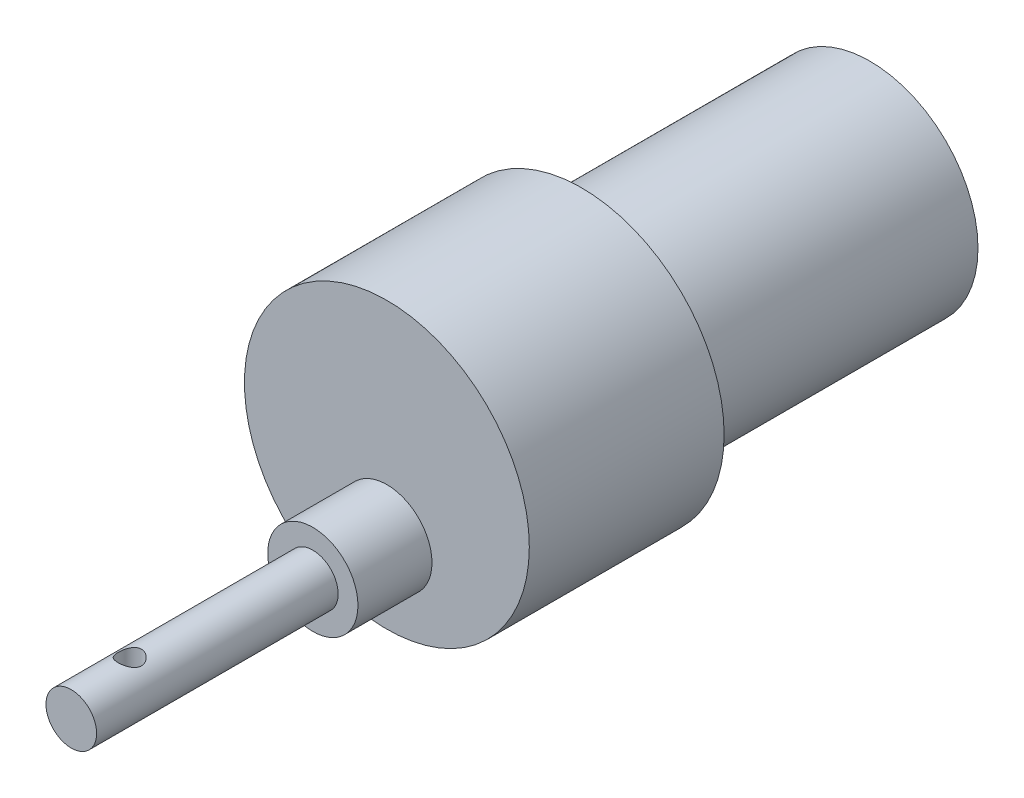
ISO-10303-21;
HEADER;
FILE_DESCRIPTION(('STEP AP214'),'2;1');
FILE_NAME('part.step','',(''),(''),'','','');
FILE_SCHEMA(('AUTOMOTIVE_DESIGN { 1 0 10303 214 1 1 1 1 }'));
ENDSEC;
DATA;
#1=APPLICATION_CONTEXT('core data for automotive mechanical design processes');
#2=APPLICATION_PROTOCOL_DEFINITION('international standard','automotive_design',2000,#1);
#3=PRODUCT_CONTEXT('',#1,'mechanical');
#4=PRODUCT('Part','Part','',(#3));
#5=PRODUCT_RELATED_PRODUCT_CATEGORY('part','',(#4));
#6=PRODUCT_DEFINITION_FORMATION('','',#4);
#7=PRODUCT_DEFINITION_CONTEXT('part definition',#1,'design');
#8=PRODUCT_DEFINITION('design','',#6,#7);
#9=PRODUCT_DEFINITION_SHAPE('','',#8);
#10=(LENGTH_UNIT() NAMED_UNIT(*) SI_UNIT(.MILLI.,.METRE.));
#11=(NAMED_UNIT(*) PLANE_ANGLE_UNIT() SI_UNIT($,.RADIAN.));
#12=(NAMED_UNIT(*) SI_UNIT($,.STERADIAN.) SOLID_ANGLE_UNIT());
#13=UNCERTAINTY_MEASURE_WITH_UNIT(LENGTH_MEASURE(1.E-05),#10,'distance_accuracy_value','');
#14=(GEOMETRIC_REPRESENTATION_CONTEXT(3) GLOBAL_UNCERTAINTY_ASSIGNED_CONTEXT((#13)) GLOBAL_UNIT_ASSIGNED_CONTEXT((#10,
#11,#12)) REPRESENTATION_CONTEXT('',''));
#15=CARTESIAN_POINT('',(0.,0.,0.));
#16=DIRECTION('',(0.,0.,1.));
#17=DIRECTION('',(1.,0.,0.));
#18=AXIS2_PLACEMENT_3D('',#15,#16,#17);
#19=CARTESIAN_POINT('',(0.,0.,62.));
#20=DIRECTION('',(0.,0.,-1.));
#21=DIRECTION('',(-1.,0.,0.));
#22=AXIS2_PLACEMENT_3D('',#19,#20,#21);
#23=CYLINDRICAL_SURFACE('',#22,13.86);
#24=CARTESIAN_POINT('',(0.,0.,0.));
#25=DIRECTION('',(0.,0.,1.));
#26=DIRECTION('',(1.,0.,0.));
#27=AXIS2_PLACEMENT_3D('',#24,#25,#26);
#28=CIRCLE('',#27,13.86);
#29=CARTESIAN_POINT('',(13.86,0.,0.));
#30=VERTEX_POINT('',#29);
#31=EDGE_CURVE('E65',#30,#30,#28,.T.);
#32=ORIENTED_EDGE('',*,*,#31,.T.);
#33=EDGE_LOOP('',(#32));
#34=FACE_BOUND('',#33,.T.);
#35=CARTESIAN_POINT('',(0.,0.,37.));
#36=DIRECTION('',(0.,0.,1.));
#37=DIRECTION('',(1.,0.,0.));
#38=AXIS2_PLACEMENT_3D('',#35,#36,#37);
#39=CIRCLE('',#38,13.86);
#40=CARTESIAN_POINT('',(13.86,0.,37.));
#41=VERTEX_POINT('',#40);
#42=EDGE_CURVE('E60',#41,#41,#39,.T.);
#43=ORIENTED_EDGE('',*,*,#42,.F.);
#44=EDGE_LOOP('',(#43));
#45=FACE_BOUND('',#44,.T.);
#46=ADVANCED_FACE('F48',(#34,#45),#23,.T.);
#47=CARTESIAN_POINT('',(0.,0.,0.));
#48=DIRECTION('',(0.,0.,1.));
#49=DIRECTION('',(1.,0.,0.));
#50=AXIS2_PLACEMENT_3D('',#47,#48,#49);
#51=PLANE('',#50);
#52=ORIENTED_EDGE('',*,*,#31,.F.);
#53=EDGE_LOOP('',(#52));
#54=FACE_BOUND('',#53,.T.);
#55=ADVANCED_FACE('F107',(#54),#51,.F.);
#56=CARTESIAN_POINT('',(0.,0.,62.));
#57=DIRECTION('',(0.,0.,-1.));
#58=DIRECTION('',(-1.,0.,0.));
#59=AXIS2_PLACEMENT_3D('',#56,#57,#58);
#60=CYLINDRICAL_SURFACE('',#59,18.28);
#61=CARTESIAN_POINT('',(0.,0.,62.));
#62=DIRECTION('',(0.,0.,1.));
#63=DIRECTION('',(1.,0.,0.));
#64=AXIS2_PLACEMENT_3D('',#61,#62,#63);
#65=CIRCLE('',#64,18.28);
#66=CARTESIAN_POINT('',(18.28,0.,62.));
#67=VERTEX_POINT('',#66);
#68=EDGE_CURVE('E77',#67,#67,#65,.T.);
#69=ORIENTED_EDGE('',*,*,#68,.F.);
#70=EDGE_LOOP('',(#69));
#71=FACE_BOUND('',#70,.T.);
#72=CARTESIAN_POINT('',(0.,0.,37.));
#73=DIRECTION('',(0.,0.,1.));
#74=DIRECTION('',(1.,0.,0.));
#75=AXIS2_PLACEMENT_3D('',#72,#73,#74);
#76=CIRCLE('',#75,18.28);
#77=CARTESIAN_POINT('',(18.28,0.,37.));
#78=VERTEX_POINT('',#77);
#79=EDGE_CURVE('E73',#78,#78,#76,.T.);
#80=ORIENTED_EDGE('',*,*,#79,.T.);
#81=EDGE_LOOP('',(#80));
#82=FACE_BOUND('',#81,.T.);
#83=ADVANCED_FACE('F112',(#71,#82),#60,.T.);
#84=CARTESIAN_POINT('',(0.,0.,37.));
#85=DIRECTION('',(0.,0.,1.));
#86=DIRECTION('',(1.,0.,0.));
#87=AXIS2_PLACEMENT_3D('',#84,#85,#86);
#88=PLANE('',#87);
#89=ORIENTED_EDGE('',*,*,#42,.T.);
#90=EDGE_LOOP('',(#89));
#91=FACE_BOUND('',#90,.T.);
#92=ORIENTED_EDGE('',*,*,#79,.F.);
#93=EDGE_LOOP('',(#92));
#94=FACE_BOUND('',#93,.T.);
#95=ADVANCED_FACE('F118',(#91,#94),#88,.F.);
#96=CARTESIAN_POINT('',(0.,0.,62.));
#97=DIRECTION('',(0.,0.,1.));
#98=DIRECTION('',(1.,0.,0.));
#99=AXIS2_PLACEMENT_3D('',#96,#97,#98);
#100=PLANE('',#99);
#101=CARTESIAN_POINT('',(0.,-7.99,62.));
#102=DIRECTION('',(0.,0.,1.));
#103=DIRECTION('',(1.,0.,0.));
#104=AXIS2_PLACEMENT_3D('',#101,#102,#103);
#105=CIRCLE('',#104,5.79);
#106=CARTESIAN_POINT('',(5.79,-7.99,62.));
#107=VERTEX_POINT('',#106);
#108=EDGE_CURVE('E74',#107,#107,#105,.T.);
#109=ORIENTED_EDGE('',*,*,#108,.F.);
#110=EDGE_LOOP('',(#109));
#111=FACE_BOUND('',#110,.T.);
#112=ORIENTED_EDGE('',*,*,#68,.T.);
#113=EDGE_LOOP('',(#112));
#114=FACE_BOUND('',#113,.T.);
#115=ADVANCED_FACE('F121',(#111,#114),#100,.T.);
#116=CARTESIAN_POINT('',(0.,-7.99,71.5));
#117=DIRECTION('',(0.,0.,-1.));
#118=DIRECTION('',(-1.,0.,0.));
#119=AXIS2_PLACEMENT_3D('',#116,#117,#118);
#120=CYLINDRICAL_SURFACE('',#119,5.79);
#121=CARTESIAN_POINT('',(0.,-7.99,71.5));
#122=DIRECTION('',(0.,0.,1.));
#123=DIRECTION('',(1.,0.,0.));
#124=AXIS2_PLACEMENT_3D('',#121,#122,#123);
#125=CIRCLE('',#124,5.79);
#126=CARTESIAN_POINT('',(5.79,-7.99,71.5));
#127=VERTEX_POINT('',#126);
#128=EDGE_CURVE('E70',#127,#127,#125,.T.);
#129=ORIENTED_EDGE('',*,*,#128,.F.);
#130=EDGE_LOOP('',(#129));
#131=FACE_BOUND('',#130,.T.);
#132=ORIENTED_EDGE('',*,*,#108,.T.);
#133=EDGE_LOOP('',(#132));
#134=FACE_BOUND('',#133,.T.);
#135=ADVANCED_FACE('F134',(#131,#134),#120,.T.);
#136=CARTESIAN_POINT('',(0.,-7.99,71.5));
#137=DIRECTION('',(0.,0.,1.));
#138=DIRECTION('',(1.,0.,0.));
#139=AXIS2_PLACEMENT_3D('',#136,#137,#138);
#140=PLANE('',#139);
#141=CARTESIAN_POINT('',(0.,-7.99,71.5));
#142=DIRECTION('',(0.,0.,1.));
#143=DIRECTION('',(1.,0.,0.));
#144=AXIS2_PLACEMENT_3D('',#141,#142,#143);
#145=CIRCLE('',#144,3.25);
#146=CARTESIAN_POINT('',(3.25,-7.99,71.5));
#147=VERTEX_POINT('',#146);
#148=EDGE_CURVE('E12',#147,#147,#145,.T.);
#149=ORIENTED_EDGE('',*,*,#148,.F.);
#150=EDGE_LOOP('',(#149));
#151=FACE_BOUND('',#150,.T.);
#152=ORIENTED_EDGE('',*,*,#128,.T.);
#153=EDGE_LOOP('',(#152));
#154=FACE_BOUND('',#153,.T.);
#155=ADVANCED_FACE('F103',(#151,#154),#140,.T.);
#156=CARTESIAN_POINT('',(0.,-7.99,102.5));
#157=DIRECTION('',(0.,0.,-1.));
#158=DIRECTION('',(-1.,0.,0.));
#159=AXIS2_PLACEMENT_3D('',#156,#157,#158);
#160=CYLINDRICAL_SURFACE('',#159,3.25);
#161=CARTESIAN_POINT('',(0.,-11.24,96.5));
#162=CARTESIAN_POINT('',(0.0795665336020402,-11.2399964824728,96.499995787521));
#163=CARTESIAN_POINT('',(0.159248802751997,-11.2370457852304,96.4936318652864));
#164=CARTESIAN_POINT('',(0.316302676462146,-11.2255347898597,96.4684368188158));
#165=CARTESIAN_POINT('',(0.393668644355887,-11.2169618132245,96.4495775159126));
#166=CARTESIAN_POINT('',(0.543571236651895,-11.1951126172015,96.4002613390825));
#167=CARTESIAN_POINT('',(0.616124459577149,-11.1818536812406,96.369847053397));
#168=CARTESIAN_POINT('',(0.75501150586327,-11.1518842864362,96.2984831664503));
#169=CARTESIAN_POINT('',(0.821346455351669,-11.1351744543117,96.2575354778342));
#170=CARTESIAN_POINT('',(0.949934488652826,-11.0988303550097,96.1637412957995));
#171=CARTESIAN_POINT('',(1.01177584846844,-11.0790871070793,96.1103730891206));
#172=CARTESIAN_POINT('',(1.12599874800721,-11.0393100602554,95.9943643723519));
#173=CARTESIAN_POINT('',(1.17837420047774,-11.0192760832839,95.9317179424784));
#174=CARTESIAN_POINT('',(1.27548887178323,-10.9797410102294,95.7941390566843));
#175=CARTESIAN_POINT('',(1.31953284801044,-10.9603543512364,95.7186793017865));
#176=CARTESIAN_POINT('',(1.39412192936299,-10.9260893954615,95.5604132530109));
#177=CARTESIAN_POINT('',(1.42467548371612,-10.9112082786405,95.4776115966009));
#178=CARTESIAN_POINT('',(1.46962454078475,-10.8888457139591,95.3117245268469));
#179=CARTESIAN_POINT('',(1.4848179245708,-10.8810015734653,95.2289063804143));
#180=CARTESIAN_POINT('',(1.50108773838038,-10.8725906668659,95.0615542706928));
#181=CARTESIAN_POINT('',(1.50217478633585,-10.8720184271594,94.9770216459131));
#182=CARTESIAN_POINT('',(1.49079280088205,-10.8779164235216,94.8175256844061));
#183=CARTESIAN_POINT('',(1.47964335102251,-10.8837011993326,94.7424372111908));
#184=CARTESIAN_POINT('',(1.44635609280636,-10.9004806782819,94.5953488838788));
#185=CARTESIAN_POINT('',(1.42421554815286,-10.911476678754,94.5233498037562));
#186=CARTESIAN_POINT('',(1.36913890476633,-10.9376945635919,94.3824957158733));
#187=CARTESIAN_POINT('',(1.33596673085205,-10.9530076322656,94.3137507726206));
#188=CARTESIAN_POINT('',(1.2599408085694,-10.9861251942995,94.1824992310562));
#189=CARTESIAN_POINT('',(1.21708286028503,-11.0039307671733,94.1199953559801));
#190=CARTESIAN_POINT('',(1.11759089744586,-11.0423140447298,93.9960295930866));
#191=CARTESIAN_POINT('',(1.05997849303938,-11.0629856005201,93.9353794713411));
#192=CARTESIAN_POINT('',(0.93525063284136,-11.1032136151515,93.8242944951355));
#193=CARTESIAN_POINT('',(0.868131859637581,-11.1227696813672,93.7738632217161));
#194=CARTESIAN_POINT('',(0.723348423753627,-11.1593883778069,93.6830680936934));
#195=CARTESIAN_POINT('',(0.645401966429369,-11.1763430967401,93.6431066922417));
#196=CARTESIAN_POINT('',(0.482909298354606,-11.2049781510309,93.5771606394507));
#197=CARTESIAN_POINT('',(0.398367620109635,-11.2166620718881,93.5511664844807));
#198=CARTESIAN_POINT('',(0.231801419726399,-11.2327218040747,93.5157584231729));
#199=CARTESIAN_POINT('',(0.150053680320634,-11.2375744913158,93.5052597924311));
#200=CARTESIAN_POINT('',(-0.0141754579229681,-11.241005131626,93.4978189350661));
#201=CARTESIAN_POINT('',(-0.0966565689646179,-11.2395854463303,93.5008716061922));
#202=CARTESIAN_POINT('',(-0.254447728851398,-11.2309269508323,93.5197405086181));
#203=CARTESIAN_POINT('',(-0.329879815922768,-11.2240647154841,93.534731016318));
#204=CARTESIAN_POINT('',(-0.47703968174818,-11.205654730005,93.5758259707681));
#205=CARTESIAN_POINT('',(-0.548767021851264,-11.1941064264594,93.6019317302237));
#206=CARTESIAN_POINT('',(-0.689005049925919,-11.1669534581523,93.6653176562795));
#207=CARTESIAN_POINT('',(-0.75734840788269,-11.1512347190555,93.7029174973217));
#208=CARTESIAN_POINT('',(-0.886999363186387,-11.1173358986766,93.7878753743237));
#209=CARTESIAN_POINT('',(-0.948303850462297,-11.0991547370659,93.8352376981244));
#210=CARTESIAN_POINT('',(-1.06771605589661,-11.0603024090195,93.9431170185809));
#211=CARTESIAN_POINT('',(-1.12509321772053,-11.0395516736676,94.0044158349319));
#212=CARTESIAN_POINT('',(-1.22901796417977,-10.9991743111415,94.1359711553179));
#213=CARTESIAN_POINT('',(-1.27556070251233,-10.9795481899615,94.206231646296));
#214=CARTESIAN_POINT('',(-1.35774539209929,-10.9431533168398,94.3565122225598));
#215=CARTESIAN_POINT('',(-1.39301513194685,-10.9264889220204,94.4367631918532));
#216=CARTESIAN_POINT('',(-1.44918714325353,-10.8991835105804,94.6030877230937));
#217=CARTESIAN_POINT('',(-1.47010488786372,-10.8885360092279,94.689154904117));
#218=CARTESIAN_POINT('',(-1.49529060984287,-10.8756174532217,94.8564321692355));
#219=CARTESIAN_POINT('',(-1.50087454782971,-10.8726853235251,94.9373929418536));
#220=CARTESIAN_POINT('',(-1.49890349615771,-10.8737114444469,95.0990993783274));
#221=CARTESIAN_POINT('',(-1.49135196602765,-10.8776678808026,95.179845093214));
#222=CARTESIAN_POINT('',(-1.4645026372222,-10.89136714358,95.3329450912279));
#223=CARTESIAN_POINT('',(-1.44606164108053,-10.9006867438273,95.4054916725594));
#224=CARTESIAN_POINT('',(-1.39890570133608,-10.9236404902673,95.5464331262932));
#225=CARTESIAN_POINT('',(-1.37018772156748,-10.9372759113608,95.6148267647851));
#226=CARTESIAN_POINT('',(-1.30114142777073,-10.9684312806135,95.7504660004963));
#227=CARTESIAN_POINT('',(-1.26017322224184,-10.9861478662505,95.8173395867084));
#228=CARTESIAN_POINT('',(-1.16858143831045,-11.0230436879651,95.9436688753762));
#229=CARTESIAN_POINT('',(-1.1179534539562,-11.0422235890751,96.0031211723353));
#230=CARTESIAN_POINT('',(-1.00267081983322,-11.0821220762857,96.1189084266444));
#231=CARTESIAN_POINT('',(-0.93713072208963,-11.1028088140642,96.1743773440259));
#232=CARTESIAN_POINT('',(-0.796983612052282,-11.1416023694661,96.2736519598549));
#233=CARTESIAN_POINT('',(-0.722372364022922,-11.1597079732006,96.3174521789542));
#234=CARTESIAN_POINT('',(-0.566452903867861,-11.1912362062055,96.3915937351064));
#235=CARTESIAN_POINT('',(-0.485194228853798,-11.2046901573167,96.4220254800127));
#236=CARTESIAN_POINT('',(-0.318047129151273,-11.2254884135612,96.468442221957));
#237=CARTESIAN_POINT('',(-0.232173392454843,-11.2328510059526,96.4844704732234));
#238=CARTESIAN_POINT('',(-0.121381352624889,-11.2378239925252,96.4952796609948));
#239=CARTESIAN_POINT('',(-0.0971493876498588,-11.2386384195862,96.4970479318607));
#240=CARTESIAN_POINT('',(-0.0486152181100391,-11.2397269656243,96.4994087555787));
#241=CARTESIAN_POINT('',(-0.0243130122848309,-11.2400010748449,96.5000012872002));
#242=CARTESIAN_POINT('',(0.,-11.24,96.5));
#243=B_SPLINE_CURVE_WITH_KNOTS('',3,(#161,#162,#163,#164,#165,#166,#167,#168,#169,#170,#171,
#172,#173,#174,#175,#176,#177,#178,#179,#180,#181,#182,#183,#184,#185,#186,#187,#188,#189,#190,
#191,#192,#193,#194,#195,#196,#197,#198,#199,#200,#201,#202,#203,#204,#205,#206,#207,#208,#209,
#210,#211,#212,#213,#214,#215,#216,#217,#218,#219,#220,#221,#222,#223,#224,#225,#226,#227,#228,
#229,#230,#231,#232,#233,#234,#235,#236,#237,#238,#239,#240,#241,#242),.UNSPECIFIED.,.T.,.F.,(4,
2,2,2,2,2,2,2,2,2,2,2,2,2,2,2,2,2,2,2,2,2,2,2,2,2,2,2,2,2,2,2,2,2,2,2,2,2,2,2,4),(0.,
0.238600102483911,0.477740118245305,0.716007153654809,0.954230955270989,1.20527368348811,
1.45647728005177,1.72361737244145,1.99058991333629,2.24284530975918,2.49491082085965,
2.72224505371486,2.94963591115234,3.18224489338961,3.41495493301191,3.67231630672516,
3.92976771345169,4.19600797435802,4.46206684922304,4.70843465098173,4.95470969975968,
5.18529144757862,5.41590043453886,5.65361863134685,5.89144146118222,6.14975555625564,
6.40818497569821,6.67442949381562,6.94038651584685,7.18267705005868,7.42490378112663,
7.65022078469501,7.87560440949581,8.11582604918685,8.35615752018291,8.6198711271926,
8.88370835055028,9.14573275427445,9.40696763362013,9.47987495044763,9.55278358376661),.UNSPECIFIED.);
#244=CARTESIAN_POINT('',(0.,-11.24,96.5));
#245=VERTEX_POINT('',#244);
#246=EDGE_CURVE('E51',#245,#245,#243,.T.);
#247=ORIENTED_EDGE('',*,*,#246,.T.);
#248=EDGE_LOOP('',(#247));
#249=FACE_BOUND('',#248,.T.);
#250=CARTESIAN_POINT('',(0.,-4.74,96.5));
#251=CARTESIAN_POINT('',(-0.0795665336020402,-4.74000351752723,96.499995787521));
#252=CARTESIAN_POINT('',(-0.159248802751997,-4.74295421476959,96.4936318652864));
#253=CARTESIAN_POINT('',(-0.316302676462146,-4.7544652101403,96.4684368188158));
#254=CARTESIAN_POINT('',(-0.393668644355887,-4.76303818677546,96.4495775159126));
#255=CARTESIAN_POINT('',(-0.543571236651895,-4.7848873827985,96.4002613390825));
#256=CARTESIAN_POINT('',(-0.616124459577149,-4.79814631875943,96.369847053397));
#257=CARTESIAN_POINT('',(-0.75501150586327,-4.82811571356377,96.2984831664503));
#258=CARTESIAN_POINT('',(-0.821346455351669,-4.84482554568835,96.2575354778342));
#259=CARTESIAN_POINT('',(-0.949934488652826,-4.88116964499027,96.1637412957995));
#260=CARTESIAN_POINT('',(-1.01177584846844,-4.90091289292072,96.1103730891206));
#261=CARTESIAN_POINT('',(-1.12599874800721,-4.94068993974456,95.9943643723519));
#262=CARTESIAN_POINT('',(-1.17837420047774,-4.96072391671612,95.9317179424784));
#263=CARTESIAN_POINT('',(-1.27548887178323,-5.00025898977059,95.7941390566843));
#264=CARTESIAN_POINT('',(-1.31953284801044,-5.01964564876359,95.7186793017865));
#265=CARTESIAN_POINT('',(-1.39412192936299,-5.05391060453849,95.5604132530109));
#266=CARTESIAN_POINT('',(-1.42467548371612,-5.06879172135948,95.4776115966009));
#267=CARTESIAN_POINT('',(-1.46962454078475,-5.09115428604094,95.3117245268469));
#268=CARTESIAN_POINT('',(-1.4848179245708,-5.0989984265347,95.2289063804143));
#269=CARTESIAN_POINT('',(-1.50108773838038,-5.10740933313408,95.0615542706928));
#270=CARTESIAN_POINT('',(-1.50217478633585,-5.10798157284062,94.9770216459131));
#271=CARTESIAN_POINT('',(-1.49079280088205,-5.10208357647845,94.8175256844061));
#272=CARTESIAN_POINT('',(-1.47964335102251,-5.09629880066741,94.7424372111908));
#273=CARTESIAN_POINT('',(-1.44635609280636,-5.07951932171808,94.5953488838788));
#274=CARTESIAN_POINT('',(-1.42421554815286,-5.06852332124604,94.5233498037562));
#275=CARTESIAN_POINT('',(-1.36913890476633,-5.04230543640806,94.3824957158733));
#276=CARTESIAN_POINT('',(-1.33596673085205,-5.02699236773443,94.3137507726206));
#277=CARTESIAN_POINT('',(-1.2599408085694,-4.99387480570052,94.1824992310562));
#278=CARTESIAN_POINT('',(-1.21708286028503,-4.97606923282669,94.1199953559801));
#279=CARTESIAN_POINT('',(-1.11759089744586,-4.93768595527021,93.9960295930866));
#280=CARTESIAN_POINT('',(-1.05997849303938,-4.91701439947994,93.9353794713411));
#281=CARTESIAN_POINT('',(-0.935250632841355,-4.87678638484851,93.8242944951355));
#282=CARTESIAN_POINT('',(-0.868131859637579,-4.85723031863276,93.7738632217161));
#283=CARTESIAN_POINT('',(-0.723348423753627,-4.82061162219313,93.6830680936934));
#284=CARTESIAN_POINT('',(-0.64540196642937,-4.80365690325991,93.6431066922417));
#285=CARTESIAN_POINT('',(-0.482909298354606,-4.77502184896911,93.5771606394507));
#286=CARTESIAN_POINT('',(-0.398367620109635,-4.76333792811189,93.5511664844807));
#287=CARTESIAN_POINT('',(-0.231801419726399,-4.7472781959253,93.5157584231729));
#288=CARTESIAN_POINT('',(-0.150053680320635,-4.74242550868423,93.5052597924311));
#289=CARTESIAN_POINT('',(0.0141754579229679,-4.73899486837397,93.4978189350661));
#290=CARTESIAN_POINT('',(0.096656568964618,-4.7404145536697,93.5008716061922));
#291=CARTESIAN_POINT('',(0.254447728851401,-4.74907304916771,93.5197405086181));
#292=CARTESIAN_POINT('',(0.329879815922774,-4.75593528451591,93.534731016318));
#293=CARTESIAN_POINT('',(0.477039681748186,-4.77434526999505,93.5758259707681));
#294=CARTESIAN_POINT('',(0.548767021851267,-4.78589357354064,93.6019317302237));
#295=CARTESIAN_POINT('',(0.689005049925918,-4.81304654184772,93.6653176562795));
#296=CARTESIAN_POINT('',(0.757348407882689,-4.8287652809445,93.7029174973217));
#297=CARTESIAN_POINT('',(0.886999363186382,-4.86266410132341,93.7878753743237));
#298=CARTESIAN_POINT('',(0.948303850462288,-4.88084526293413,93.8352376981244));
#299=CARTESIAN_POINT('',(1.0677160558966,-4.91969759098051,93.9431170185809));
#300=CARTESIAN_POINT('',(1.12509321772053,-4.94044832633235,94.0044158349319));
#301=CARTESIAN_POINT('',(1.22901796417977,-4.98082568885848,94.1359711553179));
#302=CARTESIAN_POINT('',(1.27556070251232,-5.00045181003849,94.206231646296));
#303=CARTESIAN_POINT('',(1.35774539209928,-5.03684668316023,94.3565122225598));
#304=CARTESIAN_POINT('',(1.39301513194685,-5.05351107797963,94.4367631918531));
#305=CARTESIAN_POINT('',(1.44918714325354,-5.08081648941964,94.6030877230937));
#306=CARTESIAN_POINT('',(1.47010488786372,-5.09146399077208,94.6891549041169));
#307=CARTESIAN_POINT('',(1.49529060984287,-5.10438254677831,94.8564321692355));
#308=CARTESIAN_POINT('',(1.50087454782971,-5.1073146764749,94.9373929418536));
#309=CARTESIAN_POINT('',(1.49890349615771,-5.10628855555312,95.0990993783274));
#310=CARTESIAN_POINT('',(1.49135196602765,-5.10233211919738,95.179845093214));
#311=CARTESIAN_POINT('',(1.4645026372222,-5.08863285641999,95.3329450912279));
#312=CARTESIAN_POINT('',(1.44606164108053,-5.07931325617275,95.4054916725594));
#313=CARTESIAN_POINT('',(1.39890570133608,-5.05635950973268,95.5464331262932));
#314=CARTESIAN_POINT('',(1.37018772156748,-5.04272408863924,95.6148267647851));
#315=CARTESIAN_POINT('',(1.30114142777073,-5.01156871938648,95.7504660004963));
#316=CARTESIAN_POINT('',(1.26017322224184,-4.99385213374951,95.8173395867084));
#317=CARTESIAN_POINT('',(1.16858143831045,-4.9569563120349,95.9436688753762));
#318=CARTESIAN_POINT('',(1.1179534539562,-4.93777641092492,96.0031211723353));
#319=CARTESIAN_POINT('',(1.00267081983322,-4.89787792371429,96.1189084266444));
#320=CARTESIAN_POINT('',(0.93713072208963,-4.8771911859358,96.1743773440259));
#321=CARTESIAN_POINT('',(0.796983612052281,-4.83839763053393,96.2736519598549));
#322=CARTESIAN_POINT('',(0.722372364022921,-4.82029202679941,96.3174521789542));
#323=CARTESIAN_POINT('',(0.566452903867861,-4.7887637937945,96.3915937351064));
#324=CARTESIAN_POINT('',(0.485194228853799,-4.77530984268335,96.4220254800127));
#325=CARTESIAN_POINT('',(0.318047129151273,-4.75451158643877,96.468442221957));
#326=CARTESIAN_POINT('',(0.232173392454843,-4.74714899404736,96.4844704732234));
#327=CARTESIAN_POINT('',(0.121381352624889,-4.74217600747479,96.4952796609948));
#328=CARTESIAN_POINT('',(0.0971493876498584,-4.74136158041381,96.4970479318607));
#329=CARTESIAN_POINT('',(0.048615218110039,-4.74027303437565,96.4994087555787));
#330=CARTESIAN_POINT('',(0.0243130122848308,-4.7399989251551,96.5000012872002));
#331=CARTESIAN_POINT('',(0.,-4.74,96.5));
#332=B_SPLINE_CURVE_WITH_KNOTS('',3,(#250,#251,#252,#253,#254,#255,#256,#257,#258,#259,#260,
#261,#262,#263,#264,#265,#266,#267,#268,#269,#270,#271,#272,#273,#274,#275,#276,#277,#278,#279,
#280,#281,#282,#283,#284,#285,#286,#287,#288,#289,#290,#291,#292,#293,#294,#295,#296,#297,#298,
#299,#300,#301,#302,#303,#304,#305,#306,#307,#308,#309,#310,#311,#312,#313,#314,#315,#316,#317,
#318,#319,#320,#321,#322,#323,#324,#325,#326,#327,#328,#329,#330,#331),.UNSPECIFIED.,.T.,.F.,(4,
2,2,2,2,2,2,2,2,2,2,2,2,2,2,2,2,2,2,2,2,2,2,2,2,2,2,2,2,2,2,2,2,2,2,2,2,2,2,2,4),(0.,
0.23860010248391,0.477740118245305,0.716007153654809,0.954230955270988,1.20527368348811,
1.45647728005177,1.72361737244145,1.99058991333629,2.24284530975918,2.49491082085965,
2.72224505371486,2.94963591115234,3.18224489338961,3.41495493301191,3.67231630672516,
3.92976771345169,4.19600797435802,4.46206684922304,4.70843465098173,4.95470969975968,
5.18529144757863,5.41590043453886,5.65361863134685,5.8914414611822,6.14975555625562,
6.4081849756982,6.6744294938156,6.94038651584684,7.18267705005868,7.42490378112662,
7.650220784695,7.8756044094958,8.11582604918685,8.3561575201829,8.61987112719259,
8.88370835055027,9.14573275427444,9.40696763362012,9.47987495044763,9.5527835837666),.UNSPECIFIED.);
#333=CARTESIAN_POINT('',(0.,-4.74,96.5));
#334=VERTEX_POINT('',#333);
#335=EDGE_CURVE('E83',#334,#334,#332,.T.);
#336=ORIENTED_EDGE('',*,*,#335,.T.);
#337=EDGE_LOOP('',(#336));
#338=FACE_BOUND('',#337,.T.);
#339=CARTESIAN_POINT('',(0.,-7.99,102.5));
#340=DIRECTION('',(0.,0.,1.));
#341=DIRECTION('',(1.,0.,0.));
#342=AXIS2_PLACEMENT_3D('',#339,#340,#341);
#343=CIRCLE('',#342,3.25);
#344=CARTESIAN_POINT('',(3.25,-7.99,102.5));
#345=VERTEX_POINT('',#344);
#346=EDGE_CURVE('E69',#345,#345,#343,.T.);
#347=ORIENTED_EDGE('',*,*,#346,.F.);
#348=EDGE_LOOP('',(#347));
#349=FACE_BOUND('',#348,.T.);
#350=ORIENTED_EDGE('',*,*,#148,.T.);
#351=EDGE_LOOP('',(#350));
#352=FACE_BOUND('',#351,.T.);
#353=ADVANCED_FACE('F88',(#249,#338,#349,#352),#160,.T.);
#354=CARTESIAN_POINT('',(0.,-7.99,102.5));
#355=DIRECTION('',(0.,0.,1.));
#356=DIRECTION('',(1.,0.,0.));
#357=AXIS2_PLACEMENT_3D('',#354,#355,#356);
#358=PLANE('',#357);
#359=ORIENTED_EDGE('',*,*,#346,.T.);
#360=EDGE_LOOP('',(#359));
#361=FACE_BOUND('',#360,.T.);
#362=ADVANCED_FACE('F95',(#361),#358,.T.);
#363=CARTESIAN_POINT('',(0.,-20.,95.));
#364=DIRECTION('',(0.,1.,0.));
#365=DIRECTION('',(0.,0.,1.));
#366=AXIS2_PLACEMENT_3D('',#363,#364,#365);
#367=CYLINDRICAL_SURFACE('',#366,1.5);
#368=ORIENTED_EDGE('',*,*,#335,.F.);
#369=EDGE_LOOP('',(#368));
#370=FACE_BOUND('',#369,.T.);
#371=ORIENTED_EDGE('',*,*,#246,.F.);
#372=EDGE_LOOP('',(#371));
#373=FACE_BOUND('',#372,.T.);
#374=ADVANCED_FACE('F92',(#370,#373),#367,.F.);
#375=CLOSED_SHELL('',(#46,#55,#83,#95,#115,#135,#155,#353,#362,#374));
#376=MANIFOLD_SOLID_BREP('B2',#375);
#377=ADVANCED_BREP_SHAPE_REPRESENTATION('',(#18,#376),#14);
#378=SHAPE_DEFINITION_REPRESENTATION(#9,#377);
ENDSEC;
END-ISO-10303-21;
